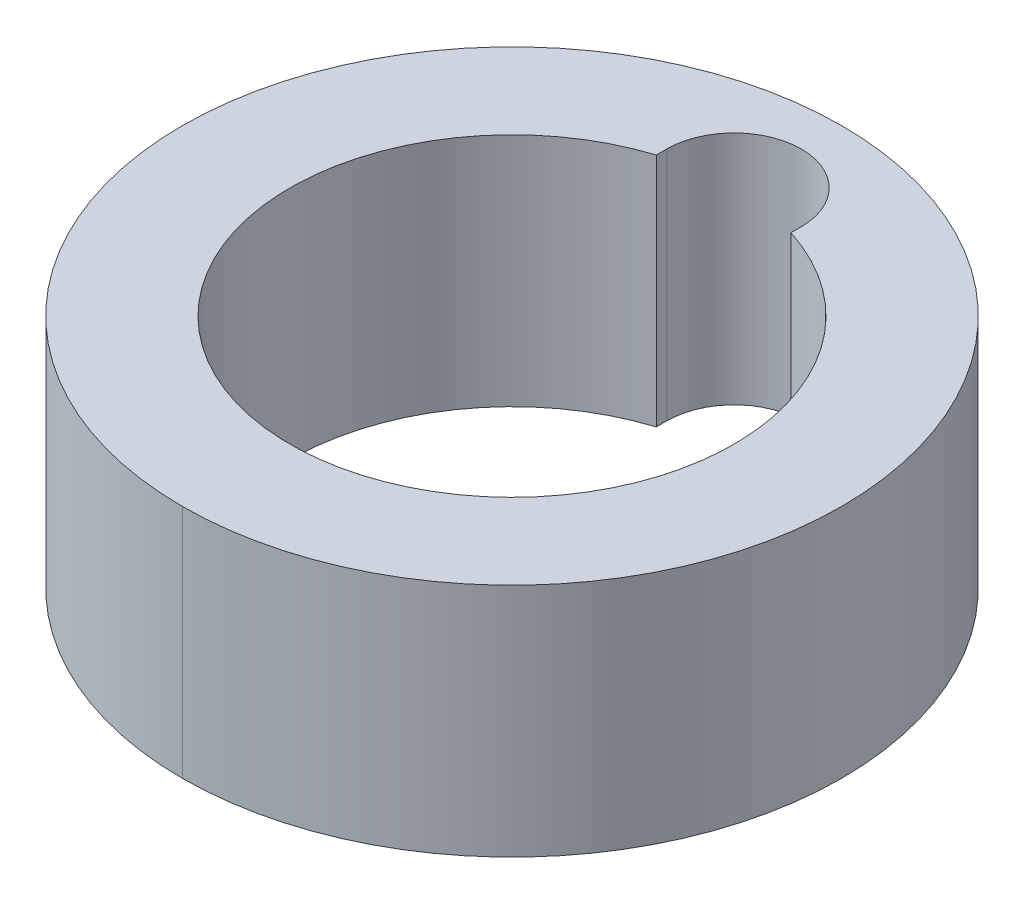
ISO-10303-21;
HEADER;
FILE_DESCRIPTION(('STEP AP214'),'2;1');
FILE_NAME('part.step','',(''),(''),'','','');
FILE_SCHEMA(('AUTOMOTIVE_DESIGN { 1 0 10303 214 1 1 1 1 }'));
ENDSEC;
DATA;
#1=APPLICATION_CONTEXT('core data for automotive mechanical design processes');
#2=APPLICATION_PROTOCOL_DEFINITION('international standard','automotive_design',2000,#1);
#3=PRODUCT_CONTEXT('',#1,'mechanical');
#4=PRODUCT('Part','Part','',(#3));
#5=PRODUCT_RELATED_PRODUCT_CATEGORY('part','',(#4));
#6=PRODUCT_DEFINITION_FORMATION('','',#4);
#7=PRODUCT_DEFINITION_CONTEXT('part definition',#1,'design');
#8=PRODUCT_DEFINITION('design','',#6,#7);
#9=PRODUCT_DEFINITION_SHAPE('','',#8);
#10=(LENGTH_UNIT() NAMED_UNIT(*) SI_UNIT(.MILLI.,.METRE.));
#11=(NAMED_UNIT(*) PLANE_ANGLE_UNIT() SI_UNIT($,.RADIAN.));
#12=(NAMED_UNIT(*) SI_UNIT($,.STERADIAN.) SOLID_ANGLE_UNIT());
#13=UNCERTAINTY_MEASURE_WITH_UNIT(LENGTH_MEASURE(1.E-05),#10,'distance_accuracy_value','');
#14=(GEOMETRIC_REPRESENTATION_CONTEXT(3) GLOBAL_UNCERTAINTY_ASSIGNED_CONTEXT((#13)) GLOBAL_UNIT_ASSIGNED_CONTEXT((#10,
#11,#12)) REPRESENTATION_CONTEXT('',''));
#15=CARTESIAN_POINT('',(0.,0.,0.));
#16=DIRECTION('',(0.,0.,1.));
#17=DIRECTION('',(1.,0.,0.));
#18=AXIS2_PLACEMENT_3D('',#15,#16,#17);
#19=CARTESIAN_POINT('',(-1.,0.,-3.3));
#20=DIRECTION('',(-1.,0.,0.));
#21=DIRECTION('',(0.,0.,1.));
#22=AXIS2_PLACEMENT_3D('',#19,#20,#21);
#23=PLANE('',#22);
#24=DIRECTION('',(0.,0.,1.));
#25=VECTOR('',#24,1.);
#26=CARTESIAN_POINT('',(-1.,3.5,-3.3));
#27=LINE('',#26,#25);
#28=CARTESIAN_POINT('',(-1.,3.5,-3.3));
#29=VERTEX_POINT('',#28);
#30=CARTESIAN_POINT('',(-1.,3.5,-3.14483703870328));
#31=VERTEX_POINT('',#30);
#32=EDGE_CURVE('E104',#29,#31,#27,.T.);
#33=ORIENTED_EDGE('',*,*,#32,.T.);
#34=DIRECTION('',(0.,1.,0.));
#35=VECTOR('',#34,1.);
#36=CARTESIAN_POINT('',(-1.,0.,-3.14483703870328));
#37=LINE('',#36,#35);
#38=CARTESIAN_POINT('',(-1.,0.,-3.14483703870328));
#39=VERTEX_POINT('',#38);
#40=EDGE_CURVE('E99',#39,#31,#37,.T.);
#41=ORIENTED_EDGE('',*,*,#40,.F.);
#42=DIRECTION('',(0.,0.,1.));
#43=VECTOR('',#42,1.);
#44=CARTESIAN_POINT('',(-1.,0.,-3.3));
#45=LINE('',#44,#43);
#46=CARTESIAN_POINT('',(-1.,0.,-3.3));
#47=VERTEX_POINT('',#46);
#48=EDGE_CURVE('E101',#47,#39,#45,.T.);
#49=ORIENTED_EDGE('',*,*,#48,.F.);
#50=DIRECTION('',(0.,1.,0.));
#51=VECTOR('',#50,1.);
#52=CARTESIAN_POINT('',(-1.,0.,-3.3));
#53=LINE('',#52,#51);
#54=EDGE_CURVE('E27',#47,#29,#53,.T.);
#55=ORIENTED_EDGE('',*,*,#54,.T.);
#56=EDGE_LOOP('',(#33,#41,#49,#55));
#57=FACE_BOUND('',#56,.T.);
#58=ADVANCED_FACE('F16',(#57),#23,.F.);
#59=CARTESIAN_POINT('',(1.,0.,-3.3));
#60=DIRECTION('',(1.,0.,0.));
#61=DIRECTION('',(0.,0.,-1.));
#62=AXIS2_PLACEMENT_3D('',#59,#60,#61);
#63=PLANE('',#62);
#64=DIRECTION('',(0.,0.,-1.));
#65=VECTOR('',#64,1.);
#66=CARTESIAN_POINT('',(1.,3.5,-3.3));
#67=LINE('',#66,#65);
#68=CARTESIAN_POINT('',(1.,3.5,-3.14483703870328));
#69=VERTEX_POINT('',#68);
#70=CARTESIAN_POINT('',(1.,3.5,-3.3));
#71=VERTEX_POINT('',#70);
#72=EDGE_CURVE('E131',#69,#71,#67,.T.);
#73=ORIENTED_EDGE('',*,*,#72,.T.);
#74=DIRECTION('',(0.,1.,0.));
#75=VECTOR('',#74,1.);
#76=CARTESIAN_POINT('',(1.,0.,-3.3));
#77=LINE('',#76,#75);
#78=CARTESIAN_POINT('',(1.,0.,-3.3));
#79=VERTEX_POINT('',#78);
#80=EDGE_CURVE('E11',#79,#71,#77,.T.);
#81=ORIENTED_EDGE('',*,*,#80,.F.);
#82=DIRECTION('',(0.,0.,-1.));
#83=VECTOR('',#82,1.);
#84=CARTESIAN_POINT('',(1.,0.,-3.3));
#85=LINE('',#84,#83);
#86=CARTESIAN_POINT('',(1.,0.,-3.14483703870328));
#87=VERTEX_POINT('',#86);
#88=EDGE_CURVE('E119',#87,#79,#85,.T.);
#89=ORIENTED_EDGE('',*,*,#88,.F.);
#90=DIRECTION('',(0.,1.,0.));
#91=VECTOR('',#90,1.);
#92=CARTESIAN_POINT('',(1.,0.,-3.14483703870328));
#93=LINE('',#92,#91);
#94=EDGE_CURVE('E85',#87,#69,#93,.T.);
#95=ORIENTED_EDGE('',*,*,#94,.T.);
#96=EDGE_LOOP('',(#73,#81,#89,#95));
#97=FACE_BOUND('',#96,.T.);
#98=ADVANCED_FACE('F187',(#97),#63,.F.);
#99=CARTESIAN_POINT('',(0.,0.,-3.3));
#100=DIRECTION('',(0.,1.,0.));
#101=DIRECTION('',(0.,0.,1.));
#102=AXIS2_PLACEMENT_3D('',#99,#100,#101);
#103=CYLINDRICAL_SURFACE('',#102,1.);
#104=CARTESIAN_POINT('',(0.,3.5,-3.3));
#105=DIRECTION('',(0.,1.,0.));
#106=DIRECTION('',(0.,0.,1.));
#107=AXIS2_PLACEMENT_3D('',#104,#105,#106);
#108=CIRCLE('',#107,1.);
#109=EDGE_CURVE('E20',#71,#29,#108,.T.);
#110=ORIENTED_EDGE('',*,*,#109,.T.);
#111=ORIENTED_EDGE('',*,*,#54,.F.);
#112=CARTESIAN_POINT('',(0.,0.,-3.3));
#113=DIRECTION('',(0.,1.,0.));
#114=DIRECTION('',(0.,0.,1.));
#115=AXIS2_PLACEMENT_3D('',#112,#113,#114);
#116=CIRCLE('',#115,1.);
#117=EDGE_CURVE('E115',#79,#47,#116,.T.);
#118=ORIENTED_EDGE('',*,*,#117,.F.);
#119=ORIENTED_EDGE('',*,*,#80,.T.);
#120=EDGE_LOOP('',(#110,#111,#118,#119));
#121=FACE_BOUND('',#120,.T.);
#122=ADVANCED_FACE('F192',(#121),#103,.F.);
#123=CARTESIAN_POINT('',(0.,3.5,0.));
#124=DIRECTION('',(0.,-1.,0.));
#125=DIRECTION('',(0.,0.,-1.));
#126=AXIS2_PLACEMENT_3D('',#123,#124,#125);
#127=CYLINDRICAL_SURFACE('',#126,3.3);
#128=ORIENTED_EDGE('',*,*,#94,.F.);
#129=CARTESIAN_POINT('',(0.,0.,0.));
#130=DIRECTION('',(0.,1.,0.));
#131=DIRECTION('',(0.,0.,1.));
#132=AXIS2_PLACEMENT_3D('',#129,#130,#131);
#133=CIRCLE('',#132,3.3);
#134=EDGE_CURVE('E114',#39,#87,#133,.T.);
#135=ORIENTED_EDGE('',*,*,#134,.F.);
#136=ORIENTED_EDGE('',*,*,#40,.T.);
#137=CARTESIAN_POINT('',(0.,3.5,0.));
#138=DIRECTION('',(0.,1.,0.));
#139=DIRECTION('',(0.,0.,1.));
#140=AXIS2_PLACEMENT_3D('',#137,#138,#139);
#141=CIRCLE('',#140,3.3);
#142=EDGE_CURVE('E134',#31,#69,#141,.T.);
#143=ORIENTED_EDGE('',*,*,#142,.T.);
#144=EDGE_LOOP('',(#128,#135,#136,#143));
#145=FACE_BOUND('',#144,.T.);
#146=ADVANCED_FACE('F18',(#145),#127,.F.);
#147=CARTESIAN_POINT('',(0.,3.5,0.));
#148=DIRECTION('',(0.,-1.,0.));
#149=DIRECTION('',(0.,0.,-1.));
#150=AXIS2_PLACEMENT_3D('',#147,#148,#149);
#151=CYLINDRICAL_SURFACE('',#150,4.9);
#152=DIRECTION('',(0.,-1.,0.));
#153=VECTOR('',#152,1.);
#154=CARTESIAN_POINT('',(0.,3.5,4.9));
#155=LINE('',#154,#153);
#156=CARTESIAN_POINT('',(0.,3.5,4.9));
#157=VERTEX_POINT('',#156);
#158=CARTESIAN_POINT('',(0.,0.,4.9));
#159=VERTEX_POINT('',#158);
#160=EDGE_CURVE('E136',#157,#159,#155,.T.);
#161=ORIENTED_EDGE('',*,*,#160,.F.);
#162=CARTESIAN_POINT('',(0.,3.5,0.));
#163=DIRECTION('',(0.,1.,0.));
#164=DIRECTION('',(0.,0.,1.));
#165=AXIS2_PLACEMENT_3D('',#162,#163,#164);
#166=CIRCLE('',#165,4.9);
#167=CARTESIAN_POINT('',(0.,3.5,-4.9));
#168=VERTEX_POINT('',#167);
#169=EDGE_CURVE('E135',#168,#157,#166,.T.);
#170=ORIENTED_EDGE('',*,*,#169,.F.);
#171=DIRECTION('',(0.,-1.,0.));
#172=VECTOR('',#171,1.);
#173=CARTESIAN_POINT('',(0.,3.5,-4.9));
#174=LINE('',#173,#172);
#175=CARTESIAN_POINT('',(0.,0.,-4.9));
#176=VERTEX_POINT('',#175);
#177=EDGE_CURVE('E151',#168,#176,#174,.T.);
#178=ORIENTED_EDGE('',*,*,#177,.T.);
#179=CARTESIAN_POINT('',(0.,0.,0.));
#180=DIRECTION('',(0.,1.,0.));
#181=DIRECTION('',(0.,0.,1.));
#182=AXIS2_PLACEMENT_3D('',#179,#180,#181);
#183=CIRCLE('',#182,4.9);
#184=EDGE_CURVE('E75',#176,#159,#183,.T.);
#185=ORIENTED_EDGE('',*,*,#184,.T.);
#186=EDGE_LOOP('',(#161,#170,#178,#185));
#187=FACE_BOUND('',#186,.T.);
#188=ADVANCED_FACE('F171',(#187),#151,.T.);
#189=CARTESIAN_POINT('',(0.,0.,0.));
#190=DIRECTION('',(0.,1.,0.));
#191=DIRECTION('',(1.,0.,0.));
#192=AXIS2_PLACEMENT_3D('',#189,#190,#191);
#193=PLANE('',#192);
#194=ORIENTED_EDGE('',*,*,#134,.T.);
#195=ORIENTED_EDGE('',*,*,#88,.T.);
#196=ORIENTED_EDGE('',*,*,#117,.T.);
#197=ORIENTED_EDGE('',*,*,#48,.T.);
#198=EDGE_LOOP('',(#194,#195,#196,#197));
#199=FACE_BOUND('',#198,.T.);
#200=ORIENTED_EDGE('',*,*,#184,.F.);
#201=CARTESIAN_POINT('',(0.,0.,0.));
#202=DIRECTION('',(0.,1.,0.));
#203=DIRECTION('',(0.,0.,1.));
#204=AXIS2_PLACEMENT_3D('',#201,#202,#203);
#205=CIRCLE('',#204,4.9);
#206=EDGE_CURVE('E139',#159,#176,#205,.T.);
#207=ORIENTED_EDGE('',*,*,#206,.F.);
#208=EDGE_LOOP('',(#200,#207));
#209=FACE_BOUND('',#208,.T.);
#210=ADVANCED_FACE('F112',(#199,#209),#193,.F.);
#211=CARTESIAN_POINT('',(0.,3.5,0.));
#212=DIRECTION('',(0.,1.,0.));
#213=DIRECTION('',(1.,0.,0.));
#214=AXIS2_PLACEMENT_3D('',#211,#212,#213);
#215=PLANE('',#214);
#216=ORIENTED_EDGE('',*,*,#72,.F.);
#217=ORIENTED_EDGE('',*,*,#142,.F.);
#218=ORIENTED_EDGE('',*,*,#32,.F.);
#219=ORIENTED_EDGE('',*,*,#109,.F.);
#220=EDGE_LOOP('',(#216,#217,#218,#219));
#221=FACE_BOUND('',#220,.T.);
#222=ORIENTED_EDGE('',*,*,#169,.T.);
#223=CARTESIAN_POINT('',(0.,3.5,0.));
#224=DIRECTION('',(0.,1.,0.));
#225=DIRECTION('',(0.,0.,1.));
#226=AXIS2_PLACEMENT_3D('',#223,#224,#225);
#227=CIRCLE('',#226,4.9);
#228=EDGE_CURVE('E129',#157,#168,#227,.T.);
#229=ORIENTED_EDGE('',*,*,#228,.T.);
#230=EDGE_LOOP('',(#222,#229));
#231=FACE_BOUND('',#230,.T.);
#232=ADVANCED_FACE('F176',(#221,#231),#215,.T.);
#233=CARTESIAN_POINT('',(0.,3.5,0.));
#234=DIRECTION('',(0.,-1.,0.));
#235=DIRECTION('',(0.,0.,-1.));
#236=AXIS2_PLACEMENT_3D('',#233,#234,#235);
#237=CYLINDRICAL_SURFACE('',#236,4.9);
#238=ORIENTED_EDGE('',*,*,#228,.F.);
#239=ORIENTED_EDGE('',*,*,#160,.T.);
#240=ORIENTED_EDGE('',*,*,#206,.T.);
#241=ORIENTED_EDGE('',*,*,#177,.F.);
#242=EDGE_LOOP('',(#238,#239,#240,#241));
#243=FACE_BOUND('',#242,.T.);
#244=ADVANCED_FACE('F174',(#243),#237,.T.);
#245=CLOSED_SHELL('',(#58,#98,#122,#146,#188,#210,#232,#244));
#246=MANIFOLD_SOLID_BREP('B1',#245);
#247=ADVANCED_BREP_SHAPE_REPRESENTATION('',(#18,#246),#14);
#248=SHAPE_DEFINITION_REPRESENTATION(#9,#247);
ENDSEC;
END-ISO-10303-21;
